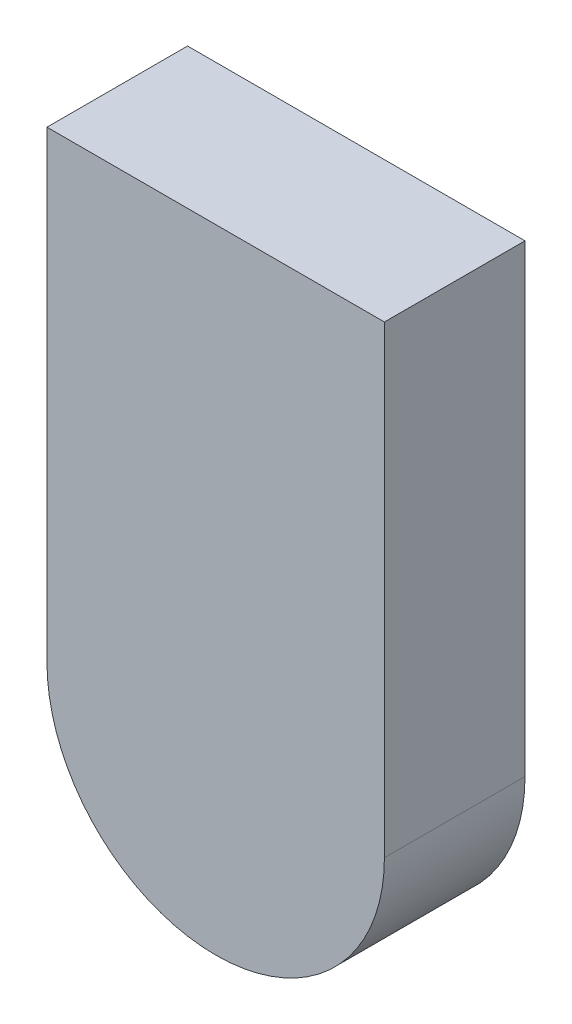
ISO-10303-21;
HEADER;
FILE_DESCRIPTION(('STEP AP214'),'2;1');
FILE_NAME('part.step','',(''),(''),'','','');
FILE_SCHEMA(('AUTOMOTIVE_DESIGN { 1 0 10303 214 1 1 1 1 }'));
ENDSEC;
DATA;
#1=APPLICATION_CONTEXT('core data for automotive mechanical design processes');
#2=APPLICATION_PROTOCOL_DEFINITION('international standard','automotive_design',2000,#1);
#3=PRODUCT_CONTEXT('',#1,'mechanical');
#4=PRODUCT('Part','Part','',(#3));
#5=PRODUCT_RELATED_PRODUCT_CATEGORY('part','',(#4));
#6=PRODUCT_DEFINITION_FORMATION('','',#4);
#7=PRODUCT_DEFINITION_CONTEXT('part definition',#1,'design');
#8=PRODUCT_DEFINITION('design','',#6,#7);
#9=PRODUCT_DEFINITION_SHAPE('','',#8);
#10=(LENGTH_UNIT() NAMED_UNIT(*) SI_UNIT(.MILLI.,.METRE.));
#11=(NAMED_UNIT(*) PLANE_ANGLE_UNIT() SI_UNIT($,.RADIAN.));
#12=(NAMED_UNIT(*) SI_UNIT($,.STERADIAN.) SOLID_ANGLE_UNIT());
#13=UNCERTAINTY_MEASURE_WITH_UNIT(LENGTH_MEASURE(1.E-05),#10,'distance_accuracy_value','');
#14=(GEOMETRIC_REPRESENTATION_CONTEXT(3) GLOBAL_UNCERTAINTY_ASSIGNED_CONTEXT((#13)) GLOBAL_UNIT_ASSIGNED_CONTEXT((#10,
#11,#12)) REPRESENTATION_CONTEXT('',''));
#15=CARTESIAN_POINT('',(0.,0.,0.));
#16=DIRECTION('',(0.,0.,1.));
#17=DIRECTION('',(1.,0.,0.));
#18=AXIS2_PLACEMENT_3D('',#15,#16,#17);
#19=CARTESIAN_POINT('',(0.63,4.05,0.));
#20=DIRECTION('',(0.,1.,0.));
#21=DIRECTION('',(1.,0.,0.));
#22=AXIS2_PLACEMENT_3D('',#19,#20,#21);
#23=PLANE('',#22);
#24=DIRECTION('',(0.,0.,1.));
#25=VECTOR('',#24,1.);
#26=CARTESIAN_POINT('',(0.63,4.05,0.));
#27=LINE('',#26,#25);
#28=CARTESIAN_POINT('',(0.63,4.05,0.));
#29=VERTEX_POINT('',#28);
#30=CARTESIAN_POINT('',(0.63,4.05,0.1));
#31=VERTEX_POINT('',#30);
#32=EDGE_CURVE('E11',#29,#31,#27,.T.);
#33=ORIENTED_EDGE('',*,*,#32,.T.);
#34=DIRECTION('',(1.,0.,0.));
#35=VECTOR('',#34,1.);
#36=CARTESIAN_POINT('',(0.63,4.05,0.1));
#37=LINE('',#36,#35);
#38=CARTESIAN_POINT('',(0.87,4.05,0.1));
#39=VERTEX_POINT('',#38);
#40=EDGE_CURVE('E24',#31,#39,#37,.T.);
#41=ORIENTED_EDGE('',*,*,#40,.T.);
#42=DIRECTION('',(0.,0.,1.));
#43=VECTOR('',#42,1.);
#44=CARTESIAN_POINT('',(0.87,4.05,0.));
#45=LINE('',#44,#43);
#46=CARTESIAN_POINT('',(0.87,4.05,0.));
#47=VERTEX_POINT('',#46);
#48=EDGE_CURVE('E85',#47,#39,#45,.T.);
#49=ORIENTED_EDGE('',*,*,#48,.F.);
#50=DIRECTION('',(1.,0.,0.));
#51=VECTOR('',#50,1.);
#52=CARTESIAN_POINT('',(0.63,4.05,0.));
#53=LINE('',#52,#51);
#54=EDGE_CURVE('E82',#29,#47,#53,.T.);
#55=ORIENTED_EDGE('',*,*,#54,.F.);
#56=EDGE_LOOP('',(#33,#41,#49,#55));
#57=FACE_BOUND('',#56,.T.);
#58=ADVANCED_FACE('F17',(#57),#23,.T.);
#59=CARTESIAN_POINT('',(0.87,4.05,0.));
#60=DIRECTION('',(1.,0.,0.));
#61=DIRECTION('',(0.,-1.,0.));
#62=AXIS2_PLACEMENT_3D('',#59,#60,#61);
#63=PLANE('',#62);
#64=ORIENTED_EDGE('',*,*,#48,.T.);
#65=DIRECTION('',(0.,-1.,0.));
#66=VECTOR('',#65,1.);
#67=CARTESIAN_POINT('',(0.87,4.05,0.1));
#68=LINE('',#67,#66);
#69=CARTESIAN_POINT('',(0.87,3.72,0.1));
#70=VERTEX_POINT('',#69);
#71=EDGE_CURVE('E80',#39,#70,#68,.T.);
#72=ORIENTED_EDGE('',*,*,#71,.T.);
#73=DIRECTION('',(0.,0.,1.));
#74=VECTOR('',#73,1.);
#75=CARTESIAN_POINT('',(0.87,3.72,0.));
#76=LINE('',#75,#74);
#77=CARTESIAN_POINT('',(0.87,3.72,0.));
#78=VERTEX_POINT('',#77);
#79=EDGE_CURVE('E60',#78,#70,#76,.T.);
#80=ORIENTED_EDGE('',*,*,#79,.F.);
#81=DIRECTION('',(0.,-1.,0.));
#82=VECTOR('',#81,1.);
#83=CARTESIAN_POINT('',(0.87,4.05,0.));
#84=LINE('',#83,#82);
#85=EDGE_CURVE('E76',#47,#78,#84,.T.);
#86=ORIENTED_EDGE('',*,*,#85,.F.);
#87=EDGE_LOOP('',(#64,#72,#80,#86));
#88=FACE_BOUND('',#87,.T.);
#89=ADVANCED_FACE('F89',(#88),#63,.T.);
#90=CARTESIAN_POINT('',(0.75,3.72,0.));
#91=DIRECTION('',(0.,0.,-1.));
#92=DIRECTION('',(1.,0.,0.));
#93=AXIS2_PLACEMENT_3D('',#90,#91,#92);
#94=CYLINDRICAL_SURFACE('',#93,0.12);
#95=CARTESIAN_POINT('',(0.75,3.72,0.));
#96=DIRECTION('',(0.,0.,1.));
#97=DIRECTION('',(1.,0.,0.));
#98=AXIS2_PLACEMENT_3D('',#95,#96,#97);
#99=CIRCLE('',#98,0.12);
#100=CARTESIAN_POINT('',(0.63,3.72,0.));
#101=VERTEX_POINT('',#100);
#102=EDGE_CURVE('E64',#101,#78,#99,.T.);
#103=ORIENTED_EDGE('',*,*,#102,.T.);
#104=ORIENTED_EDGE('',*,*,#79,.T.);
#105=CARTESIAN_POINT('',(0.75,3.72,0.1));
#106=DIRECTION('',(0.,0.,1.));
#107=DIRECTION('',(1.,0.,0.));
#108=AXIS2_PLACEMENT_3D('',#105,#106,#107);
#109=CIRCLE('',#108,0.12);
#110=CARTESIAN_POINT('',(0.63,3.72,0.1));
#111=VERTEX_POINT('',#110);
#112=EDGE_CURVE('E55',#111,#70,#109,.T.);
#113=ORIENTED_EDGE('',*,*,#112,.F.);
#114=DIRECTION('',(0.,0.,1.));
#115=VECTOR('',#114,1.);
#116=CARTESIAN_POINT('',(0.63,3.72,0.));
#117=LINE('',#116,#115);
#118=EDGE_CURVE('E59',#101,#111,#117,.T.);
#119=ORIENTED_EDGE('',*,*,#118,.F.);
#120=EDGE_LOOP('',(#103,#104,#113,#119));
#121=FACE_BOUND('',#120,.T.);
#122=ADVANCED_FACE('F58',(#121),#94,.T.);
#123=CARTESIAN_POINT('',(0.63,4.05,0.));
#124=DIRECTION('',(1.,0.,0.));
#125=DIRECTION('',(0.,-1.,0.));
#126=AXIS2_PLACEMENT_3D('',#123,#124,#125);
#127=PLANE('',#126);
#128=DIRECTION('',(0.,-1.,0.));
#129=VECTOR('',#128,1.);
#130=CARTESIAN_POINT('',(0.63,4.05,0.));
#131=LINE('',#130,#129);
#132=EDGE_CURVE('E69',#29,#101,#131,.T.);
#133=ORIENTED_EDGE('',*,*,#132,.T.);
#134=ORIENTED_EDGE('',*,*,#118,.T.);
#135=DIRECTION('',(0.,-1.,0.));
#136=VECTOR('',#135,1.);
#137=CARTESIAN_POINT('',(0.63,4.05,0.1));
#138=LINE('',#137,#136);
#139=EDGE_CURVE('E67',#31,#111,#138,.T.);
#140=ORIENTED_EDGE('',*,*,#139,.F.);
#141=ORIENTED_EDGE('',*,*,#32,.F.);
#142=EDGE_LOOP('',(#133,#134,#140,#141));
#143=FACE_BOUND('',#142,.T.);
#144=ADVANCED_FACE('F66',(#143),#127,.F.);
#145=CARTESIAN_POINT('',(0.75,3.849490847913,0.));
#146=DIRECTION('',(0.,0.,-1.));
#147=DIRECTION('',(-1.,0.,0.));
#148=AXIS2_PLACEMENT_3D('',#145,#146,#147);
#149=PLANE('',#148);
#150=ORIENTED_EDGE('',*,*,#54,.T.);
#151=ORIENTED_EDGE('',*,*,#85,.T.);
#152=ORIENTED_EDGE('',*,*,#102,.F.);
#153=ORIENTED_EDGE('',*,*,#132,.F.);
#154=EDGE_LOOP('',(#150,#151,#152,#153));
#155=FACE_BOUND('',#154,.T.);
#156=ADVANCED_FACE('F91',(#155),#149,.T.);
#157=CARTESIAN_POINT('',(0.75,3.849490847913,0.1));
#158=DIRECTION('',(0.,0.,-1.));
#159=DIRECTION('',(-1.,0.,0.));
#160=AXIS2_PLACEMENT_3D('',#157,#158,#159);
#161=PLANE('',#160);
#162=ORIENTED_EDGE('',*,*,#139,.T.);
#163=ORIENTED_EDGE('',*,*,#112,.T.);
#164=ORIENTED_EDGE('',*,*,#71,.F.);
#165=ORIENTED_EDGE('',*,*,#40,.F.);
#166=EDGE_LOOP('',(#162,#163,#164,#165));
#167=FACE_BOUND('',#166,.T.);
#168=ADVANCED_FACE('F71',(#167),#161,.F.);
#169=CLOSED_SHELL('',(#58,#89,#122,#144,#156,#168));
#170=MANIFOLD_SOLID_BREP('B1',#169);
#171=ADVANCED_BREP_SHAPE_REPRESENTATION('',(#18,#170),#14);
#172=SHAPE_DEFINITION_REPRESENTATION(#9,#171);
ENDSEC;
END-ISO-10303-21;
